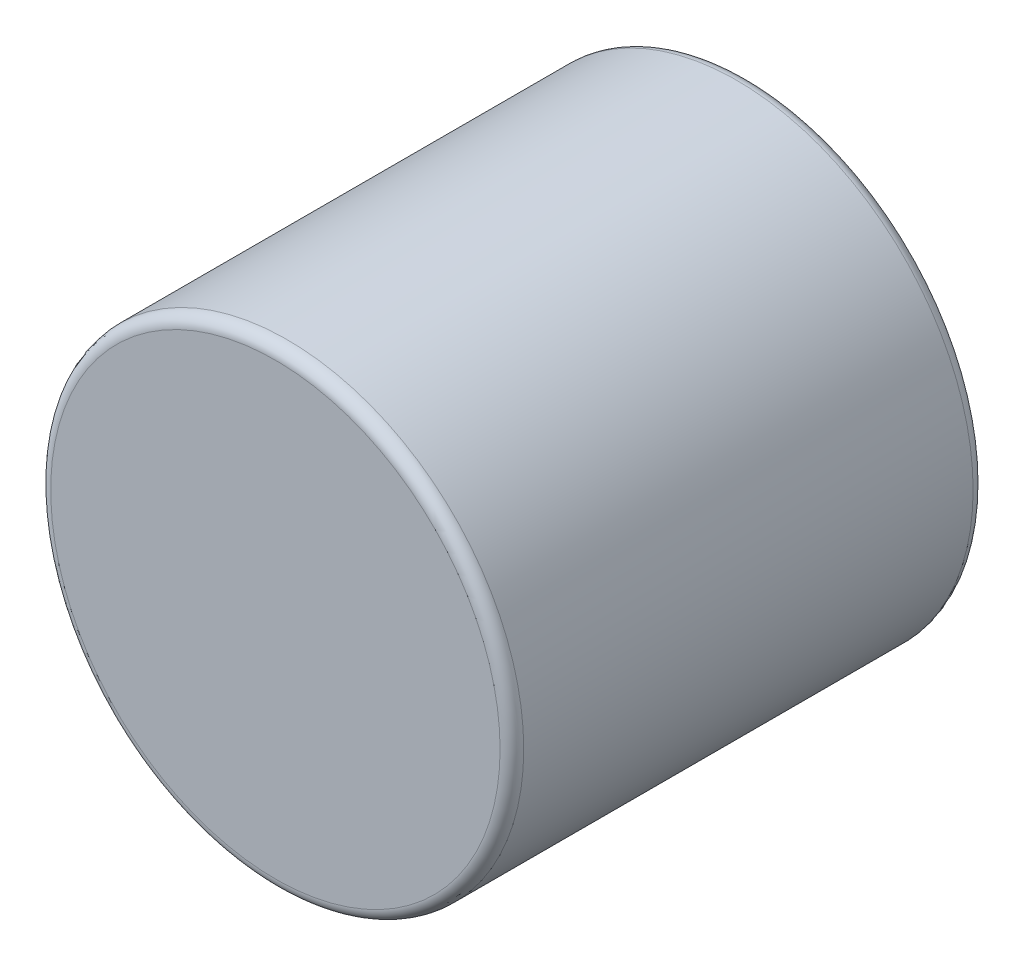
ISO-10303-21;
HEADER;
FILE_DESCRIPTION(('STEP AP214'),'2;1');
FILE_NAME('part.step','',(''),(''),'','','');
FILE_SCHEMA(('AUTOMOTIVE_DESIGN { 1 0 10303 214 1 1 1 1 }'));
ENDSEC;
DATA;
#1=APPLICATION_CONTEXT('core data for automotive mechanical design processes');
#2=APPLICATION_PROTOCOL_DEFINITION('international standard','automotive_design',2000,#1);
#3=PRODUCT_CONTEXT('',#1,'mechanical');
#4=PRODUCT('Part','Part','',(#3));
#5=PRODUCT_RELATED_PRODUCT_CATEGORY('part','',(#4));
#6=PRODUCT_DEFINITION_FORMATION('','',#4);
#7=PRODUCT_DEFINITION_CONTEXT('part definition',#1,'design');
#8=PRODUCT_DEFINITION('design','',#6,#7);
#9=PRODUCT_DEFINITION_SHAPE('','',#8);
#10=(LENGTH_UNIT() NAMED_UNIT(*) SI_UNIT(.MILLI.,.METRE.));
#11=(NAMED_UNIT(*) PLANE_ANGLE_UNIT() SI_UNIT($,.RADIAN.));
#12=(NAMED_UNIT(*) SI_UNIT($,.STERADIAN.) SOLID_ANGLE_UNIT());
#13=UNCERTAINTY_MEASURE_WITH_UNIT(LENGTH_MEASURE(1.E-05),#10,'distance_accuracy_value','');
#14=(GEOMETRIC_REPRESENTATION_CONTEXT(3) GLOBAL_UNCERTAINTY_ASSIGNED_CONTEXT((#13)) GLOBAL_UNIT_ASSIGNED_CONTEXT((#10,
#11,#12)) REPRESENTATION_CONTEXT('',''));
#15=CARTESIAN_POINT('',(0.,0.,0.));
#16=DIRECTION('',(0.,0.,1.));
#17=DIRECTION('',(1.,0.,0.));
#18=AXIS2_PLACEMENT_3D('',#15,#16,#17);
#19=CARTESIAN_POINT('',(0.,0.,1.5875));
#20=DIRECTION('',(0.,0.,-1.));
#21=DIRECTION('',(-1.,0.,0.));
#22=AXIS2_PLACEMENT_3D('',#19,#20,#21);
#23=CYLINDRICAL_SURFACE('',#22,1.5875);
#24=CARTESIAN_POINT('',(0.,0.,-1.508125));
#25=DIRECTION('',(0.,0.,1.));
#26=DIRECTION('',(1.,0.,0.));
#27=AXIS2_PLACEMENT_3D('',#24,#25,#26);
#28=CIRCLE('',#27,1.5875);
#29=CARTESIAN_POINT('',(1.5875,0.,-1.508125));
#30=VERTEX_POINT('',#29);
#31=EDGE_CURVE('E48',#30,#30,#28,.T.);
#32=ORIENTED_EDGE('',*,*,#31,.T.);
#33=EDGE_LOOP('',(#32));
#34=FACE_BOUND('',#33,.T.);
#35=CARTESIAN_POINT('',(0.,0.,1.508125));
#36=DIRECTION('',(0.,0.,1.));
#37=DIRECTION('',(1.,0.,0.));
#38=AXIS2_PLACEMENT_3D('',#35,#36,#37);
#39=CIRCLE('',#38,1.5875);
#40=CARTESIAN_POINT('',(1.5875,0.,1.508125));
#41=VERTEX_POINT('',#40);
#42=EDGE_CURVE('E52',#41,#41,#39,.F.);
#43=ORIENTED_EDGE('',*,*,#42,.T.);
#44=EDGE_LOOP('',(#43));
#45=FACE_BOUND('',#44,.T.);
#46=ADVANCED_FACE('F37',(#34,#45),#23,.T.);
#47=CARTESIAN_POINT('',(0.,0.,1.5875));
#48=DIRECTION('',(0.,0.,1.));
#49=DIRECTION('',(1.,0.,0.));
#50=AXIS2_PLACEMENT_3D('',#47,#48,#49);
#51=PLANE('',#50);
#52=CARTESIAN_POINT('',(0.,0.,1.5875));
#53=DIRECTION('',(0.,0.,1.));
#54=DIRECTION('',(1.,0.,0.));
#55=AXIS2_PLACEMENT_3D('',#52,#53,#54);
#56=CIRCLE('',#55,1.508125);
#57=CARTESIAN_POINT('',(1.508125,0.,1.5875));
#58=VERTEX_POINT('',#57);
#59=EDGE_CURVE('E10',#58,#58,#56,.T.);
#60=ORIENTED_EDGE('',*,*,#59,.T.);
#61=EDGE_LOOP('',(#60));
#62=FACE_BOUND('',#61,.T.);
#63=ADVANCED_FACE('F68',(#62),#51,.T.);
#64=CARTESIAN_POINT('',(0.,0.,-1.5875));
#65=DIRECTION('',(0.,0.,1.));
#66=DIRECTION('',(1.,0.,0.));
#67=AXIS2_PLACEMENT_3D('',#64,#65,#66);
#68=PLANE('',#67);
#69=CARTESIAN_POINT('',(0.,0.,-1.5875));
#70=DIRECTION('',(0.,0.,1.));
#71=DIRECTION('',(1.,0.,0.));
#72=AXIS2_PLACEMENT_3D('',#69,#70,#71);
#73=CIRCLE('',#72,1.508125);
#74=CARTESIAN_POINT('',(1.508125,0.,-1.5875));
#75=VERTEX_POINT('',#74);
#76=EDGE_CURVE('E44',#75,#75,#73,.F.);
#77=ORIENTED_EDGE('',*,*,#76,.T.);
#78=EDGE_LOOP('',(#77));
#79=FACE_BOUND('',#78,.T.);
#80=ADVANCED_FACE('F65',(#79),#68,.F.);
#81=CARTESIAN_POINT('',(0.,0.,-1.508125));
#82=DIRECTION('',(0.,0.,1.));
#83=DIRECTION('',(1.,0.,0.));
#84=AXIS2_PLACEMENT_3D('',#81,#82,#83);
#85=TOROIDAL_SURFACE('',#84,1.508125,0.079375);
#86=ORIENTED_EDGE('',*,*,#76,.F.);
#87=EDGE_LOOP('',(#86));
#88=FACE_BOUND('',#87,.T.);
#89=ORIENTED_EDGE('',*,*,#31,.F.);
#90=EDGE_LOOP('',(#89));
#91=FACE_BOUND('',#90,.T.);
#92=ADVANCED_FACE('F61',(#88,#91),#85,.T.);
#93=CARTESIAN_POINT('',(0.,0.,1.508125));
#94=DIRECTION('',(0.,0.,1.));
#95=DIRECTION('',(1.,0.,0.));
#96=AXIS2_PLACEMENT_3D('',#93,#94,#95);
#97=TOROIDAL_SURFACE('',#96,1.508125,0.079375);
#98=ORIENTED_EDGE('',*,*,#42,.F.);
#99=EDGE_LOOP('',(#98));
#100=FACE_BOUND('',#99,.T.);
#101=ORIENTED_EDGE('',*,*,#59,.F.);
#102=EDGE_LOOP('',(#101));
#103=FACE_BOUND('',#102,.T.);
#104=ADVANCED_FACE('F39',(#100,#103),#97,.T.);
#105=CLOSED_SHELL('',(#46,#63,#80,#92,#104));
#106=MANIFOLD_SOLID_BREP('B2',#105);
#107=ADVANCED_BREP_SHAPE_REPRESENTATION('',(#18,#106),#14);
#108=SHAPE_DEFINITION_REPRESENTATION(#9,#107);
ENDSEC;
END-ISO-10303-21;
